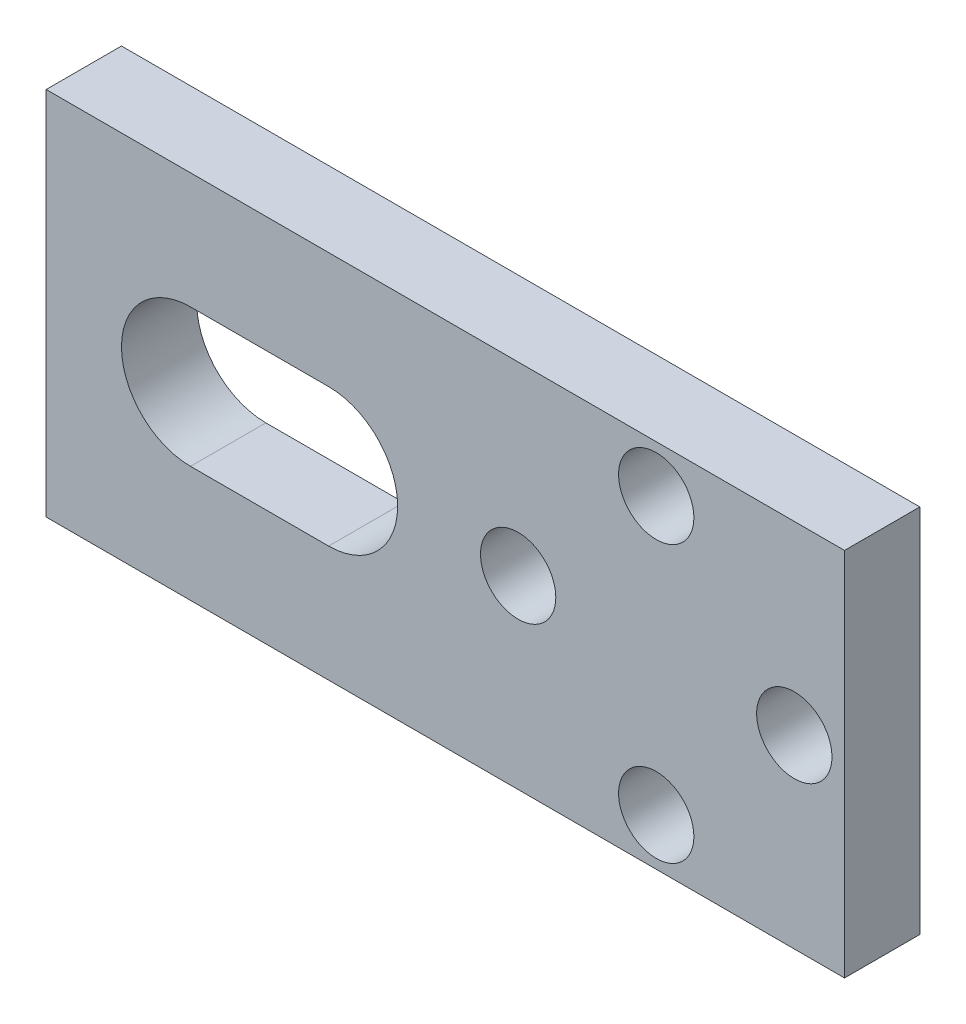
ISO-10303-21;
HEADER;
FILE_DESCRIPTION(('STEP AP214'),'2;1');
FILE_NAME('part.step','',(''),(''),'','','');
FILE_SCHEMA(('AUTOMOTIVE_DESIGN { 1 0 10303 214 1 1 1 1 }'));
ENDSEC;
DATA;
#1=APPLICATION_CONTEXT('core data for automotive mechanical design processes');
#2=APPLICATION_PROTOCOL_DEFINITION('international standard','automotive_design',2000,#1);
#3=PRODUCT_CONTEXT('',#1,'mechanical');
#4=PRODUCT('Part','Part','',(#3));
#5=PRODUCT_RELATED_PRODUCT_CATEGORY('part','',(#4));
#6=PRODUCT_DEFINITION_FORMATION('','',#4);
#7=PRODUCT_DEFINITION_CONTEXT('part definition',#1,'design');
#8=PRODUCT_DEFINITION('design','',#6,#7);
#9=PRODUCT_DEFINITION_SHAPE('','',#8);
#10=(LENGTH_UNIT() NAMED_UNIT(*) SI_UNIT(.MILLI.,.METRE.));
#11=(NAMED_UNIT(*) PLANE_ANGLE_UNIT() SI_UNIT($,.RADIAN.));
#12=(NAMED_UNIT(*) SI_UNIT($,.STERADIAN.) SOLID_ANGLE_UNIT());
#13=UNCERTAINTY_MEASURE_WITH_UNIT(LENGTH_MEASURE(1.E-05),#10,'distance_accuracy_value','');
#14=(GEOMETRIC_REPRESENTATION_CONTEXT(3) GLOBAL_UNCERTAINTY_ASSIGNED_CONTEXT((#13)) GLOBAL_UNIT_ASSIGNED_CONTEXT((#10,
#11,#12)) REPRESENTATION_CONTEXT('',''));
#15=CARTESIAN_POINT('',(0.,0.,0.));
#16=DIRECTION('',(0.,0.,1.));
#17=DIRECTION('',(1.,0.,0.));
#18=AXIS2_PLACEMENT_3D('',#15,#16,#17);
#19=CARTESIAN_POINT('',(0.,0.,3.));
#20=DIRECTION('',(0.,0.,-1.));
#21=DIRECTION('',(-1.,0.,0.));
#22=AXIS2_PLACEMENT_3D('',#19,#20,#21);
#23=PLANE('',#22);
#24=CARTESIAN_POINT('',(24.3,12.875,3.));
#25=DIRECTION('',(0.,0.,1.));
#26=DIRECTION('',(1.,0.,0.));
#27=AXIS2_PLACEMENT_3D('',#24,#25,#26);
#28=CIRCLE('',#27,1.5);
#29=CARTESIAN_POINT('',(25.8,12.875,3.));
#30=VERTEX_POINT('',#29);
#31=EDGE_CURVE('E246',#30,#30,#28,.T.);
#32=ORIENTED_EDGE('',*,*,#31,.F.);
#33=EDGE_LOOP('',(#32));
#34=FACE_BOUND('',#33,.T.);
#35=CARTESIAN_POINT('',(29.8,7.375,3.));
#36=DIRECTION('',(0.,0.,1.));
#37=DIRECTION('',(1.,0.,0.));
#38=AXIS2_PLACEMENT_3D('',#35,#36,#37);
#39=CIRCLE('',#38,1.5);
#40=CARTESIAN_POINT('',(31.3,7.375,3.));
#41=VERTEX_POINT('',#40);
#42=EDGE_CURVE('E127',#41,#41,#39,.T.);
#43=ORIENTED_EDGE('',*,*,#42,.F.);
#44=EDGE_LOOP('',(#43));
#45=FACE_BOUND('',#44,.T.);
#46=DIRECTION('',(0.,-1.,0.));
#47=VECTOR('',#46,1.);
#48=CARTESIAN_POINT('',(0.,0.,3.));
#49=LINE('',#48,#47);
#50=CARTESIAN_POINT('',(0.,14.75,3.));
#51=VERTEX_POINT('',#50);
#52=CARTESIAN_POINT('',(0.,0.,3.));
#53=VERTEX_POINT('',#52);
#54=EDGE_CURVE('E137',#51,#53,#49,.T.);
#55=ORIENTED_EDGE('',*,*,#54,.T.);
#56=DIRECTION('',(1.,0.,0.));
#57=VECTOR('',#56,1.);
#58=CARTESIAN_POINT('',(0.,0.,3.));
#59=LINE('',#58,#57);
#60=CARTESIAN_POINT('',(31.8,0.,3.));
#61=VERTEX_POINT('',#60);
#62=EDGE_CURVE('E140',#53,#61,#59,.T.);
#63=ORIENTED_EDGE('',*,*,#62,.T.);
#64=DIRECTION('',(0.,1.,0.));
#65=VECTOR('',#64,1.);
#66=CARTESIAN_POINT('',(31.8,0.,3.));
#67=LINE('',#66,#65);
#68=CARTESIAN_POINT('',(31.8,14.75,3.));
#69=VERTEX_POINT('',#68);
#70=EDGE_CURVE('E143',#61,#69,#67,.T.);
#71=ORIENTED_EDGE('',*,*,#70,.T.);
#72=DIRECTION('',(-1.,0.,0.));
#73=VECTOR('',#72,1.);
#74=CARTESIAN_POINT('',(0.,14.75,3.));
#75=LINE('',#74,#73);
#76=EDGE_CURVE('E145',#69,#51,#75,.T.);
#77=ORIENTED_EDGE('',*,*,#76,.T.);
#78=EDGE_LOOP('',(#55,#63,#71,#77));
#79=FACE_BOUND('',#78,.T.);
#80=CARTESIAN_POINT('',(5.75,7.375,3.));
#81=DIRECTION('',(0.,0.,1.));
#82=DIRECTION('',(1.,0.,0.));
#83=AXIS2_PLACEMENT_3D('',#80,#81,#82);
#84=CIRCLE('',#83,2.75);
#85=CARTESIAN_POINT('',(5.75,10.125,3.));
#86=VERTEX_POINT('',#85);
#87=CARTESIAN_POINT('',(5.75,4.625,3.));
#88=VERTEX_POINT('',#87);
#89=EDGE_CURVE('E98',#86,#88,#84,.T.);
#90=ORIENTED_EDGE('',*,*,#89,.F.);
#91=DIRECTION('',(-1.,0.,0.));
#92=VECTOR('',#91,1.);
#93=CARTESIAN_POINT('',(5.75,10.125,3.));
#94=LINE('',#93,#92);
#95=CARTESIAN_POINT('',(11.25,10.125,3.));
#96=VERTEX_POINT('',#95);
#97=EDGE_CURVE('E121',#96,#86,#94,.T.);
#98=ORIENTED_EDGE('',*,*,#97,.F.);
#99=CARTESIAN_POINT('',(11.25,7.375,3.));
#100=DIRECTION('',(0.,0.,1.));
#101=DIRECTION('',(1.,0.,0.));
#102=AXIS2_PLACEMENT_3D('',#99,#100,#101);
#103=CIRCLE('',#102,2.75);
#104=CARTESIAN_POINT('',(11.25,4.625,3.));
#105=VERTEX_POINT('',#104);
#106=EDGE_CURVE('E119',#105,#96,#103,.T.);
#107=ORIENTED_EDGE('',*,*,#106,.F.);
#108=DIRECTION('',(1.,0.,0.));
#109=VECTOR('',#108,1.);
#110=CARTESIAN_POINT('',(5.75,4.625,3.));
#111=LINE('',#110,#109);
#112=EDGE_CURVE('E106',#88,#105,#111,.T.);
#113=ORIENTED_EDGE('',*,*,#112,.F.);
#114=EDGE_LOOP('',(#90,#98,#107,#113));
#115=FACE_BOUND('',#114,.T.);
#116=CARTESIAN_POINT('',(18.8,7.375,3.));
#117=DIRECTION('',(0.,0.,1.));
#118=DIRECTION('',(1.,0.,0.));
#119=AXIS2_PLACEMENT_3D('',#116,#117,#118);
#120=CIRCLE('',#119,1.5);
#121=CARTESIAN_POINT('',(20.3,7.375,3.));
#122=VERTEX_POINT('',#121);
#123=EDGE_CURVE('E252',#122,#122,#120,.T.);
#124=ORIENTED_EDGE('',*,*,#123,.F.);
#125=EDGE_LOOP('',(#124));
#126=FACE_BOUND('',#125,.T.);
#127=CARTESIAN_POINT('',(24.3,1.875,3.));
#128=DIRECTION('',(0.,0.,1.));
#129=DIRECTION('',(1.,0.,0.));
#130=AXIS2_PLACEMENT_3D('',#127,#128,#129);
#131=CIRCLE('',#130,1.5);
#132=CARTESIAN_POINT('',(25.8,1.875,3.));
#133=VERTEX_POINT('',#132);
#134=EDGE_CURVE('E237',#133,#133,#131,.T.);
#135=ORIENTED_EDGE('',*,*,#134,.F.);
#136=EDGE_LOOP('',(#135));
#137=FACE_BOUND('',#136,.T.);
#138=ADVANCED_FACE('F33',(#34,#45,#79,#115,#126,#137),#23,.F.);
#139=CARTESIAN_POINT('',(0.,0.,0.));
#140=DIRECTION('',(0.,0.,-1.));
#141=DIRECTION('',(-1.,0.,0.));
#142=AXIS2_PLACEMENT_3D('',#139,#140,#141);
#143=PLANE('',#142);
#144=CARTESIAN_POINT('',(24.3,12.875,0.));
#145=DIRECTION('',(0.,0.,1.));
#146=DIRECTION('',(1.,0.,0.));
#147=AXIS2_PLACEMENT_3D('',#144,#145,#146);
#148=CIRCLE('',#147,1.5);
#149=CARTESIAN_POINT('',(25.8,12.875,0.));
#150=VERTEX_POINT('',#149);
#151=EDGE_CURVE('E243',#150,#150,#148,.T.);
#152=ORIENTED_EDGE('',*,*,#151,.T.);
#153=EDGE_LOOP('',(#152));
#154=FACE_BOUND('',#153,.T.);
#155=CARTESIAN_POINT('',(29.8,7.375,0.));
#156=DIRECTION('',(0.,0.,1.));
#157=DIRECTION('',(1.,0.,0.));
#158=AXIS2_PLACEMENT_3D('',#155,#156,#157);
#159=CIRCLE('',#158,1.5);
#160=CARTESIAN_POINT('',(31.3,7.375,0.));
#161=VERTEX_POINT('',#160);
#162=EDGE_CURVE('E255',#161,#161,#159,.T.);
#163=ORIENTED_EDGE('',*,*,#162,.T.);
#164=EDGE_LOOP('',(#163));
#165=FACE_BOUND('',#164,.T.);
#166=DIRECTION('',(0.,-1.,0.));
#167=VECTOR('',#166,1.);
#168=CARTESIAN_POINT('',(0.,0.,0.));
#169=LINE('',#168,#167);
#170=CARTESIAN_POINT('',(0.,14.75,0.));
#171=VERTEX_POINT('',#170);
#172=CARTESIAN_POINT('',(0.,0.,0.));
#173=VERTEX_POINT('',#172);
#174=EDGE_CURVE('E114',#171,#173,#169,.T.);
#175=ORIENTED_EDGE('',*,*,#174,.F.);
#176=DIRECTION('',(-1.,0.,0.));
#177=VECTOR('',#176,1.);
#178=CARTESIAN_POINT('',(0.,14.75,0.));
#179=LINE('',#178,#177);
#180=CARTESIAN_POINT('',(31.8,14.75,0.));
#181=VERTEX_POINT('',#180);
#182=EDGE_CURVE('E141',#181,#171,#179,.T.);
#183=ORIENTED_EDGE('',*,*,#182,.F.);
#184=DIRECTION('',(0.,1.,0.));
#185=VECTOR('',#184,1.);
#186=CARTESIAN_POINT('',(31.8,0.,0.));
#187=LINE('',#186,#185);
#188=CARTESIAN_POINT('',(31.8,0.,0.));
#189=VERTEX_POINT('',#188);
#190=EDGE_CURVE('E152',#189,#181,#187,.T.);
#191=ORIENTED_EDGE('',*,*,#190,.F.);
#192=DIRECTION('',(1.,0.,0.));
#193=VECTOR('',#192,1.);
#194=CARTESIAN_POINT('',(0.,0.,0.));
#195=LINE('',#194,#193);
#196=EDGE_CURVE('E150',#173,#189,#195,.T.);
#197=ORIENTED_EDGE('',*,*,#196,.F.);
#198=EDGE_LOOP('',(#175,#183,#191,#197));
#199=FACE_BOUND('',#198,.T.);
#200=DIRECTION('',(-1.,0.,0.));
#201=VECTOR('',#200,1.);
#202=CARTESIAN_POINT('',(5.75,10.125,0.));
#203=LINE('',#202,#201);
#204=CARTESIAN_POINT('',(11.25,10.125,0.));
#205=VERTEX_POINT('',#204);
#206=CARTESIAN_POINT('',(5.75,10.125,0.));
#207=VERTEX_POINT('',#206);
#208=EDGE_CURVE('E107',#205,#207,#203,.T.);
#209=ORIENTED_EDGE('',*,*,#208,.T.);
#210=CARTESIAN_POINT('',(5.75,7.375,0.));
#211=DIRECTION('',(0.,0.,1.));
#212=DIRECTION('',(1.,0.,0.));
#213=AXIS2_PLACEMENT_3D('',#210,#211,#212);
#214=CIRCLE('',#213,2.75);
#215=CARTESIAN_POINT('',(5.75,4.625,0.));
#216=VERTEX_POINT('',#215);
#217=EDGE_CURVE('E56',#207,#216,#214,.T.);
#218=ORIENTED_EDGE('',*,*,#217,.T.);
#219=DIRECTION('',(1.,0.,0.));
#220=VECTOR('',#219,1.);
#221=CARTESIAN_POINT('',(5.75,4.625,0.));
#222=LINE('',#221,#220);
#223=CARTESIAN_POINT('',(11.25,4.625,0.));
#224=VERTEX_POINT('',#223);
#225=EDGE_CURVE('E113',#216,#224,#222,.T.);
#226=ORIENTED_EDGE('',*,*,#225,.T.);
#227=CARTESIAN_POINT('',(11.25,7.375,0.));
#228=DIRECTION('',(0.,0.,1.));
#229=DIRECTION('',(1.,0.,0.));
#230=AXIS2_PLACEMENT_3D('',#227,#228,#229);
#231=CIRCLE('',#230,2.75);
#232=EDGE_CURVE('E129',#224,#205,#231,.T.);
#233=ORIENTED_EDGE('',*,*,#232,.T.);
#234=EDGE_LOOP('',(#209,#218,#226,#233));
#235=FACE_BOUND('',#234,.T.);
#236=CARTESIAN_POINT('',(18.8,7.375,0.));
#237=DIRECTION('',(0.,0.,1.));
#238=DIRECTION('',(1.,0.,0.));
#239=AXIS2_PLACEMENT_3D('',#236,#237,#238);
#240=CIRCLE('',#239,1.5);
#241=CARTESIAN_POINT('',(20.3,7.375,0.));
#242=VERTEX_POINT('',#241);
#243=EDGE_CURVE('E249',#242,#242,#240,.T.);
#244=ORIENTED_EDGE('',*,*,#243,.T.);
#245=EDGE_LOOP('',(#244));
#246=FACE_BOUND('',#245,.T.);
#247=CARTESIAN_POINT('',(24.3,1.875,0.));
#248=DIRECTION('',(0.,0.,1.));
#249=DIRECTION('',(1.,0.,0.));
#250=AXIS2_PLACEMENT_3D('',#247,#248,#249);
#251=CIRCLE('',#250,1.5);
#252=CARTESIAN_POINT('',(25.8,1.875,0.));
#253=VERTEX_POINT('',#252);
#254=EDGE_CURVE('E240',#253,#253,#251,.T.);
#255=ORIENTED_EDGE('',*,*,#254,.T.);
#256=EDGE_LOOP('',(#255));
#257=FACE_BOUND('',#256,.T.);
#258=ADVANCED_FACE('F170',(#154,#165,#199,#235,#246,#257),#143,.T.);
#259=CARTESIAN_POINT('',(0.,0.,3.));
#260=DIRECTION('',(1.,0.,0.));
#261=DIRECTION('',(0.,0.,-1.));
#262=AXIS2_PLACEMENT_3D('',#259,#260,#261);
#263=PLANE('',#262);
#264=ORIENTED_EDGE('',*,*,#174,.T.);
#265=DIRECTION('',(0.,0.,-1.));
#266=VECTOR('',#265,1.);
#267=CARTESIAN_POINT('',(0.,0.,3.));
#268=LINE('',#267,#266);
#269=EDGE_CURVE('E11',#53,#173,#268,.T.);
#270=ORIENTED_EDGE('',*,*,#269,.F.);
#271=ORIENTED_EDGE('',*,*,#54,.F.);
#272=DIRECTION('',(0.,0.,-1.));
#273=VECTOR('',#272,1.);
#274=CARTESIAN_POINT('',(0.,14.75,3.));
#275=LINE('',#274,#273);
#276=EDGE_CURVE('E147',#51,#171,#275,.T.);
#277=ORIENTED_EDGE('',*,*,#276,.T.);
#278=EDGE_LOOP('',(#264,#270,#271,#277));
#279=FACE_BOUND('',#278,.T.);
#280=ADVANCED_FACE('F35',(#279),#263,.F.);
#281=CARTESIAN_POINT('',(0.,0.,3.));
#282=DIRECTION('',(0.,1.,0.));
#283=DIRECTION('',(0.,0.,1.));
#284=AXIS2_PLACEMENT_3D('',#281,#282,#283);
#285=PLANE('',#284);
#286=ORIENTED_EDGE('',*,*,#196,.T.);
#287=DIRECTION('',(0.,0.,-1.));
#288=VECTOR('',#287,1.);
#289=CARTESIAN_POINT('',(31.8,0.,3.));
#290=LINE('',#289,#288);
#291=EDGE_CURVE('E41',#61,#189,#290,.T.);
#292=ORIENTED_EDGE('',*,*,#291,.F.);
#293=ORIENTED_EDGE('',*,*,#62,.F.);
#294=ORIENTED_EDGE('',*,*,#269,.T.);
#295=EDGE_LOOP('',(#286,#292,#293,#294));
#296=FACE_BOUND('',#295,.T.);
#297=ADVANCED_FACE('F180',(#296),#285,.F.);
#298=CARTESIAN_POINT('',(31.8,0.,3.));
#299=DIRECTION('',(-1.,0.,0.));
#300=DIRECTION('',(0.,0.,1.));
#301=AXIS2_PLACEMENT_3D('',#298,#299,#300);
#302=PLANE('',#301);
#303=ORIENTED_EDGE('',*,*,#190,.T.);
#304=DIRECTION('',(0.,0.,-1.));
#305=VECTOR('',#304,1.);
#306=CARTESIAN_POINT('',(31.8,14.75,3.));
#307=LINE('',#306,#305);
#308=EDGE_CURVE('E157',#69,#181,#307,.T.);
#309=ORIENTED_EDGE('',*,*,#308,.F.);
#310=ORIENTED_EDGE('',*,*,#70,.F.);
#311=ORIENTED_EDGE('',*,*,#291,.T.);
#312=EDGE_LOOP('',(#303,#309,#310,#311));
#313=FACE_BOUND('',#312,.T.);
#314=ADVANCED_FACE('F164',(#313),#302,.F.);
#315=CARTESIAN_POINT('',(0.,14.75,3.));
#316=DIRECTION('',(0.,-1.,0.));
#317=DIRECTION('',(0.,0.,-1.));
#318=AXIS2_PLACEMENT_3D('',#315,#316,#317);
#319=PLANE('',#318);
#320=ORIENTED_EDGE('',*,*,#182,.T.);
#321=ORIENTED_EDGE('',*,*,#276,.F.);
#322=ORIENTED_EDGE('',*,*,#76,.F.);
#323=ORIENTED_EDGE('',*,*,#308,.T.);
#324=EDGE_LOOP('',(#320,#321,#322,#323));
#325=FACE_BOUND('',#324,.T.);
#326=ADVANCED_FACE('F174',(#325),#319,.F.);
#327=CARTESIAN_POINT('',(5.75,7.375,3.));
#328=DIRECTION('',(0.,0.,-1.));
#329=DIRECTION('',(-1.,0.,0.));
#330=AXIS2_PLACEMENT_3D('',#327,#328,#329);
#331=CYLINDRICAL_SURFACE('',#330,2.75);
#332=ORIENTED_EDGE('',*,*,#217,.F.);
#333=DIRECTION('',(0.,0.,-1.));
#334=VECTOR('',#333,1.);
#335=CARTESIAN_POINT('',(5.75,10.125,3.));
#336=LINE('',#335,#334);
#337=EDGE_CURVE('E102',#86,#207,#336,.T.);
#338=ORIENTED_EDGE('',*,*,#337,.F.);
#339=ORIENTED_EDGE('',*,*,#89,.T.);
#340=DIRECTION('',(0.,0.,-1.));
#341=VECTOR('',#340,1.);
#342=CARTESIAN_POINT('',(5.75,4.625,3.));
#343=LINE('',#342,#341);
#344=EDGE_CURVE('E101',#88,#216,#343,.T.);
#345=ORIENTED_EDGE('',*,*,#344,.T.);
#346=EDGE_LOOP('',(#332,#338,#339,#345));
#347=FACE_BOUND('',#346,.T.);
#348=ADVANCED_FACE('F100',(#347),#331,.F.);
#349=CARTESIAN_POINT('',(5.75,4.625,3.));
#350=DIRECTION('',(0.,1.,0.));
#351=DIRECTION('',(-1.,0.,0.));
#352=AXIS2_PLACEMENT_3D('',#349,#350,#351);
#353=PLANE('',#352);
#354=ORIENTED_EDGE('',*,*,#225,.F.);
#355=ORIENTED_EDGE('',*,*,#344,.F.);
#356=ORIENTED_EDGE('',*,*,#112,.T.);
#357=DIRECTION('',(0.,0.,-1.));
#358=VECTOR('',#357,1.);
#359=CARTESIAN_POINT('',(11.25,4.625,3.));
#360=LINE('',#359,#358);
#361=EDGE_CURVE('E115',#105,#224,#360,.T.);
#362=ORIENTED_EDGE('',*,*,#361,.T.);
#363=EDGE_LOOP('',(#354,#355,#356,#362));
#364=FACE_BOUND('',#363,.T.);
#365=ADVANCED_FACE('F110',(#364),#353,.T.);
#366=CARTESIAN_POINT('',(11.25,7.375,3.));
#367=DIRECTION('',(0.,0.,-1.));
#368=DIRECTION('',(-1.,0.,0.));
#369=AXIS2_PLACEMENT_3D('',#366,#367,#368);
#370=CYLINDRICAL_SURFACE('',#369,2.75);
#371=ORIENTED_EDGE('',*,*,#232,.F.);
#372=ORIENTED_EDGE('',*,*,#361,.F.);
#373=ORIENTED_EDGE('',*,*,#106,.T.);
#374=DIRECTION('',(0.,0.,-1.));
#375=VECTOR('',#374,1.);
#376=CARTESIAN_POINT('',(11.25,10.125,3.));
#377=LINE('',#376,#375);
#378=EDGE_CURVE('E48',#96,#205,#377,.T.);
#379=ORIENTED_EDGE('',*,*,#378,.T.);
#380=EDGE_LOOP('',(#371,#372,#373,#379));
#381=FACE_BOUND('',#380,.T.);
#382=ADVANCED_FACE('F207',(#381),#370,.F.);
#383=CARTESIAN_POINT('',(5.75,10.125,3.));
#384=DIRECTION('',(0.,-1.,0.));
#385=DIRECTION('',(0.,0.,-1.));
#386=AXIS2_PLACEMENT_3D('',#383,#384,#385);
#387=PLANE('',#386);
#388=ORIENTED_EDGE('',*,*,#208,.F.);
#389=ORIENTED_EDGE('',*,*,#378,.F.);
#390=ORIENTED_EDGE('',*,*,#97,.T.);
#391=ORIENTED_EDGE('',*,*,#337,.T.);
#392=EDGE_LOOP('',(#388,#389,#390,#391));
#393=FACE_BOUND('',#392,.T.);
#394=ADVANCED_FACE('F211',(#393),#387,.T.);
#395=CARTESIAN_POINT('',(29.8,7.375,3.));
#396=DIRECTION('',(0.,0.,-1.));
#397=DIRECTION('',(-1.,0.,0.));
#398=AXIS2_PLACEMENT_3D('',#395,#396,#397);
#399=CYLINDRICAL_SURFACE('',#398,1.5);
#400=ORIENTED_EDGE('',*,*,#42,.T.);
#401=EDGE_LOOP('',(#400));
#402=FACE_BOUND('',#401,.T.);
#403=ORIENTED_EDGE('',*,*,#162,.F.);
#404=EDGE_LOOP('',(#403));
#405=FACE_BOUND('',#404,.T.);
#406=ADVANCED_FACE('F217',(#402,#405),#399,.F.);
#407=CARTESIAN_POINT('',(18.8,7.375,3.));
#408=DIRECTION('',(0.,0.,-1.));
#409=DIRECTION('',(-1.,0.,0.));
#410=AXIS2_PLACEMENT_3D('',#407,#408,#409);
#411=CYLINDRICAL_SURFACE('',#410,1.5);
#412=ORIENTED_EDGE('',*,*,#123,.T.);
#413=EDGE_LOOP('',(#412));
#414=FACE_BOUND('',#413,.T.);
#415=ORIENTED_EDGE('',*,*,#243,.F.);
#416=EDGE_LOOP('',(#415));
#417=FACE_BOUND('',#416,.T.);
#418=ADVANCED_FACE('F220',(#414,#417),#411,.F.);
#419=CARTESIAN_POINT('',(24.3,12.875,3.));
#420=DIRECTION('',(0.,0.,-1.));
#421=DIRECTION('',(-1.,0.,0.));
#422=AXIS2_PLACEMENT_3D('',#419,#420,#421);
#423=CYLINDRICAL_SURFACE('',#422,1.5);
#424=ORIENTED_EDGE('',*,*,#31,.T.);
#425=EDGE_LOOP('',(#424));
#426=FACE_BOUND('',#425,.T.);
#427=ORIENTED_EDGE('',*,*,#151,.F.);
#428=EDGE_LOOP('',(#427));
#429=FACE_BOUND('',#428,.T.);
#430=ADVANCED_FACE('F224',(#426,#429),#423,.F.);
#431=CARTESIAN_POINT('',(24.3,1.875,3.));
#432=DIRECTION('',(0.,0.,-1.));
#433=DIRECTION('',(-1.,0.,0.));
#434=AXIS2_PLACEMENT_3D('',#431,#432,#433);
#435=CYLINDRICAL_SURFACE('',#434,1.5);
#436=ORIENTED_EDGE('',*,*,#134,.T.);
#437=EDGE_LOOP('',(#436));
#438=FACE_BOUND('',#437,.T.);
#439=ORIENTED_EDGE('',*,*,#254,.F.);
#440=EDGE_LOOP('',(#439));
#441=FACE_BOUND('',#440,.T.);
#442=ADVANCED_FACE('F228',(#438,#441),#435,.F.);
#443=CLOSED_SHELL('',(#138,#258,#280,#297,#314,#326,#348,#365,#382,#394,#406,#418,#430,#442));
#444=MANIFOLD_SOLID_BREP('B2',#443);
#445=ADVANCED_BREP_SHAPE_REPRESENTATION('',(#18,#444),#14);
#446=SHAPE_DEFINITION_REPRESENTATION(#9,#445);
ENDSEC;
END-ISO-10303-21;
